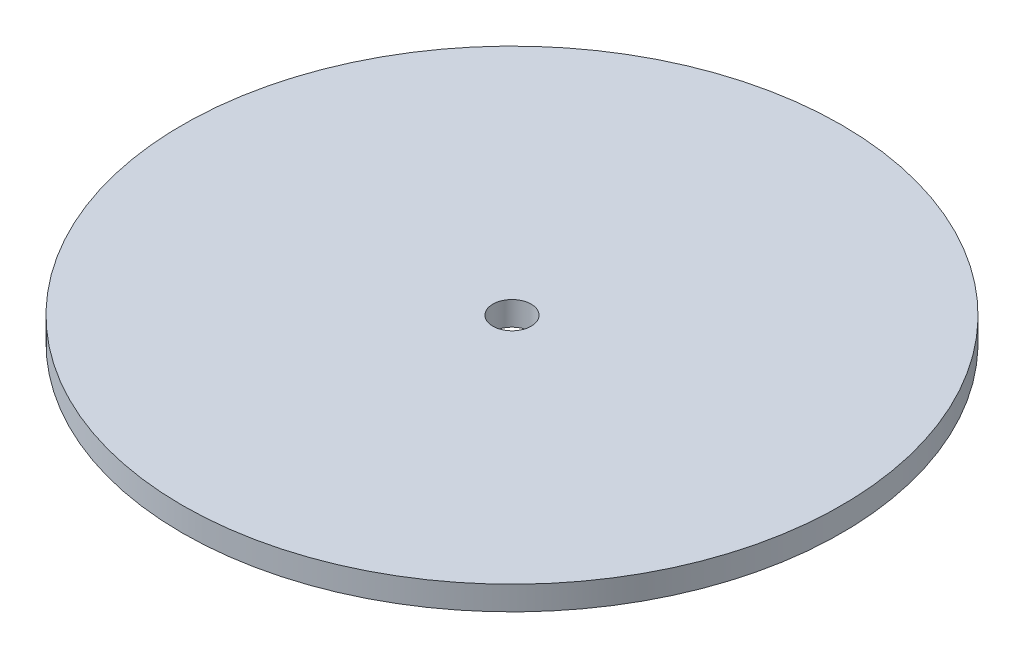
ISO-10303-21;
HEADER;
FILE_DESCRIPTION(('STEP AP214'),'2;1');
FILE_NAME('part.step','',(''),(''),'','','');
FILE_SCHEMA(('AUTOMOTIVE_DESIGN { 1 0 10303 214 1 1 1 1 }'));
ENDSEC;
DATA;
#1=APPLICATION_CONTEXT('core data for automotive mechanical design processes');
#2=APPLICATION_PROTOCOL_DEFINITION('international standard','automotive_design',2000,#1);
#3=PRODUCT_CONTEXT('',#1,'mechanical');
#4=PRODUCT('Part','Part','',(#3));
#5=PRODUCT_RELATED_PRODUCT_CATEGORY('part','',(#4));
#6=PRODUCT_DEFINITION_FORMATION('','',#4);
#7=PRODUCT_DEFINITION_CONTEXT('part definition',#1,'design');
#8=PRODUCT_DEFINITION('design','',#6,#7);
#9=PRODUCT_DEFINITION_SHAPE('','',#8);
#10=(LENGTH_UNIT() NAMED_UNIT(*) SI_UNIT(.MILLI.,.METRE.));
#11=(NAMED_UNIT(*) PLANE_ANGLE_UNIT() SI_UNIT($,.RADIAN.));
#12=(NAMED_UNIT(*) SI_UNIT($,.STERADIAN.) SOLID_ANGLE_UNIT());
#13=UNCERTAINTY_MEASURE_WITH_UNIT(LENGTH_MEASURE(1.E-05),#10,'distance_accuracy_value','');
#14=(GEOMETRIC_REPRESENTATION_CONTEXT(3) GLOBAL_UNCERTAINTY_ASSIGNED_CONTEXT((#13)) GLOBAL_UNIT_ASSIGNED_CONTEXT((#10,
#11,#12)) REPRESENTATION_CONTEXT('',''));
#15=CARTESIAN_POINT('',(0.,0.,0.));
#16=DIRECTION('',(0.,0.,1.));
#17=DIRECTION('',(1.,0.,0.));
#18=AXIS2_PLACEMENT_3D('',#15,#16,#17);
#19=CARTESIAN_POINT('',(0.,10.,0.));
#20=DIRECTION('',(0.,-1.,0.));
#21=DIRECTION('',(0.,0.,-1.));
#22=AXIS2_PLACEMENT_3D('',#19,#20,#21);
#23=CYLINDRICAL_SURFACE('',#22,137.5);
#24=CARTESIAN_POINT('',(0.,10.,0.));
#25=DIRECTION('',(0.,1.,0.));
#26=DIRECTION('',(0.,0.,1.));
#27=AXIS2_PLACEMENT_3D('',#24,#25,#26);
#28=CIRCLE('',#27,137.5);
#29=CARTESIAN_POINT('',(0.,10.,137.5));
#30=VERTEX_POINT('',#29);
#31=EDGE_CURVE('E10',#30,#30,#28,.T.);
#32=ORIENTED_EDGE('',*,*,#31,.F.);
#33=EDGE_LOOP('',(#32));
#34=FACE_BOUND('',#33,.T.);
#35=CARTESIAN_POINT('',(0.,0.,0.));
#36=DIRECTION('',(0.,1.,0.));
#37=DIRECTION('',(0.,0.,1.));
#38=AXIS2_PLACEMENT_3D('',#35,#36,#37);
#39=CIRCLE('',#38,137.5);
#40=CARTESIAN_POINT('',(0.,0.,137.5));
#41=VERTEX_POINT('',#40);
#42=EDGE_CURVE('E37',#41,#41,#39,.T.);
#43=ORIENTED_EDGE('',*,*,#42,.T.);
#44=EDGE_LOOP('',(#43));
#45=FACE_BOUND('',#44,.T.);
#46=ADVANCED_FACE('F34',(#34,#45),#23,.T.);
#47=CARTESIAN_POINT('',(0.,10.,0.));
#48=DIRECTION('',(0.,1.,0.));
#49=DIRECTION('',(0.,0.,1.));
#50=AXIS2_PLACEMENT_3D('',#47,#48,#49);
#51=PLANE('',#50);
#52=CARTESIAN_POINT('',(0.,10.,0.));
#53=DIRECTION('',(0.,1.,0.));
#54=DIRECTION('',(0.,0.,1.));
#55=AXIS2_PLACEMENT_3D('',#52,#53,#54);
#56=CIRCLE('',#55,8.);
#57=CARTESIAN_POINT('',(0.,10.,8.));
#58=VERTEX_POINT('',#57);
#59=EDGE_CURVE('E46',#58,#58,#56,.T.);
#60=ORIENTED_EDGE('',*,*,#59,.F.);
#61=EDGE_LOOP('',(#60));
#62=FACE_BOUND('',#61,.T.);
#63=ORIENTED_EDGE('',*,*,#31,.T.);
#64=EDGE_LOOP('',(#63));
#65=FACE_BOUND('',#64,.T.);
#66=ADVANCED_FACE('F61',(#62,#65),#51,.T.);
#67=CARTESIAN_POINT('',(0.,0.,0.));
#68=DIRECTION('',(0.,1.,0.));
#69=DIRECTION('',(0.,0.,1.));
#70=AXIS2_PLACEMENT_3D('',#67,#68,#69);
#71=PLANE('',#70);
#72=CARTESIAN_POINT('',(0.,0.,0.));
#73=DIRECTION('',(0.,1.,0.));
#74=DIRECTION('',(0.,0.,1.));
#75=AXIS2_PLACEMENT_3D('',#72,#73,#74);
#76=CIRCLE('',#75,8.);
#77=CARTESIAN_POINT('',(0.,0.,8.));
#78=VERTEX_POINT('',#77);
#79=EDGE_CURVE('E44',#78,#78,#76,.T.);
#80=ORIENTED_EDGE('',*,*,#79,.T.);
#81=EDGE_LOOP('',(#80));
#82=FACE_BOUND('',#81,.T.);
#83=ORIENTED_EDGE('',*,*,#42,.F.);
#84=EDGE_LOOP('',(#83));
#85=FACE_BOUND('',#84,.T.);
#86=ADVANCED_FACE('F52',(#82,#85),#71,.F.);
#87=CARTESIAN_POINT('',(0.,0.,0.));
#88=DIRECTION('',(0.,1.,0.));
#89=DIRECTION('',(0.,0.,1.));
#90=AXIS2_PLACEMENT_3D('',#87,#88,#89);
#91=CYLINDRICAL_SURFACE('',#90,8.);
#92=ORIENTED_EDGE('',*,*,#79,.F.);
#93=EDGE_LOOP('',(#92));
#94=FACE_BOUND('',#93,.T.);
#95=ORIENTED_EDGE('',*,*,#59,.T.);
#96=EDGE_LOOP('',(#95));
#97=FACE_BOUND('',#96,.T.);
#98=ADVANCED_FACE('F55',(#94,#97),#91,.F.);
#99=CLOSED_SHELL('',(#46,#66,#86,#98));
#100=MANIFOLD_SOLID_BREP('B2',#99);
#101=ADVANCED_BREP_SHAPE_REPRESENTATION('',(#18,#100),#14);
#102=SHAPE_DEFINITION_REPRESENTATION(#9,#101);
ENDSEC;
END-ISO-10303-21;
